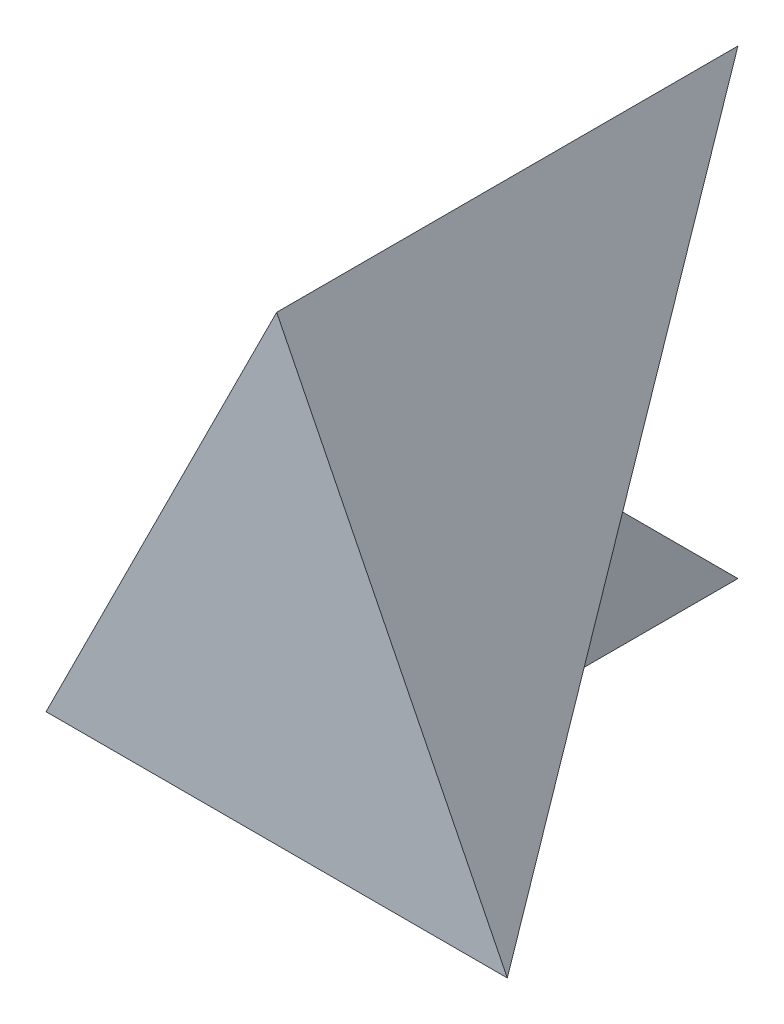
ISO-10303-21;
HEADER;
FILE_DESCRIPTION(('STEP AP214'),'2;1');
FILE_NAME('part.step','',(''),(''),'','','');
FILE_SCHEMA(('AUTOMOTIVE_DESIGN { 1 0 10303 214 1 1 1 1 }'));
ENDSEC;
DATA;
#1=APPLICATION_CONTEXT('core data for automotive mechanical design processes');
#2=APPLICATION_PROTOCOL_DEFINITION('international standard','automotive_design',2000,#1);
#3=PRODUCT_CONTEXT('',#1,'mechanical');
#4=PRODUCT('Part','Part','',(#3));
#5=PRODUCT_RELATED_PRODUCT_CATEGORY('part','',(#4));
#6=PRODUCT_DEFINITION_FORMATION('','',#4);
#7=PRODUCT_DEFINITION_CONTEXT('part definition',#1,'design');
#8=PRODUCT_DEFINITION('design','',#6,#7);
#9=PRODUCT_DEFINITION_SHAPE('','',#8);
#10=(LENGTH_UNIT() NAMED_UNIT(*) SI_UNIT(.MILLI.,.METRE.));
#11=(NAMED_UNIT(*) PLANE_ANGLE_UNIT() SI_UNIT($,.RADIAN.));
#12=(NAMED_UNIT(*) SI_UNIT($,.STERADIAN.) SOLID_ANGLE_UNIT());
#13=UNCERTAINTY_MEASURE_WITH_UNIT(LENGTH_MEASURE(1.E-05),#10,'distance_accuracy_value','');
#14=(GEOMETRIC_REPRESENTATION_CONTEXT(3) GLOBAL_UNCERTAINTY_ASSIGNED_CONTEXT((#13)) GLOBAL_UNIT_ASSIGNED_CONTEXT((#10,
#11,#12)) REPRESENTATION_CONTEXT('',''));
#15=CARTESIAN_POINT('',(0.,0.,0.));
#16=DIRECTION('',(0.,0.,1.));
#17=DIRECTION('',(1.,0.,0.));
#18=AXIS2_PLACEMENT_3D('',#15,#16,#17);
#19=CARTESIAN_POINT('',(-2.,4.,2.));
#20=DIRECTION('',(0.,0.,-1.));
#21=DIRECTION('',(-1.,0.,0.));
#22=AXIS2_PLACEMENT_3D('',#19,#20,#21);
#23=PLANE('',#22);
#24=DIRECTION('',(0.447213595499958,0.894427190999916,0.));
#25=VECTOR('',#24,1.);
#26=CARTESIAN_POINT('',(-0.400000000000001,3.2,2.));
#27=LINE('',#26,#25);
#28=CARTESIAN_POINT('',(-2.,0.,2.));
#29=VERTEX_POINT('',#28);
#30=CARTESIAN_POINT('',(0.,4.,2.));
#31=VERTEX_POINT('',#30);
#32=EDGE_CURVE('E41',#29,#31,#27,.T.);
#33=ORIENTED_EDGE('',*,*,#32,.F.);
#34=DIRECTION('',(1.,0.,0.));
#35=VECTOR('',#34,1.);
#36=CARTESIAN_POINT('',(-2.,0.,2.));
#37=LINE('',#36,#35);
#38=CARTESIAN_POINT('',(0.,0.,2.));
#39=VERTEX_POINT('',#38);
#40=EDGE_CURVE('E107',#29,#39,#37,.T.);
#41=ORIENTED_EDGE('',*,*,#40,.T.);
#42=DIRECTION('',(1.,0.,0.));
#43=VECTOR('',#42,1.);
#44=CARTESIAN_POINT('',(0.,0.,2.));
#45=LINE('',#44,#43);
#46=CARTESIAN_POINT('',(2.,0.,2.));
#47=VERTEX_POINT('',#46);
#48=EDGE_CURVE('E74',#39,#47,#45,.T.);
#49=ORIENTED_EDGE('',*,*,#48,.T.);
#50=DIRECTION('',(-0.447213595499958,0.894427190999916,0.));
#51=VECTOR('',#50,1.);
#52=CARTESIAN_POINT('',(1.6,0.8,2.));
#53=LINE('',#52,#51);
#54=EDGE_CURVE('E72',#47,#31,#53,.T.);
#55=ORIENTED_EDGE('',*,*,#54,.T.);
#56=EDGE_LOOP('',(#33,#41,#49,#55));
#57=FACE_BOUND('',#56,.T.);
#58=ADVANCED_FACE('F33',(#57),#23,.F.);
#59=CARTESIAN_POINT('',(0.,0.,0.));
#60=DIRECTION('',(0.,-1.,0.));
#61=DIRECTION('',(0.,0.,-1.));
#62=AXIS2_PLACEMENT_3D('',#59,#60,#61);
#63=PLANE('',#62);
#64=ORIENTED_EDGE('',*,*,#40,.F.);
#65=DIRECTION('',(-0.447213595499958,0.,0.894427190999916));
#66=VECTOR('',#65,1.);
#67=CARTESIAN_POINT('',(0.,0.,-2.));
#68=LINE('',#67,#66);
#69=CARTESIAN_POINT('',(0.,0.,-2.));
#70=VERTEX_POINT('',#69);
#71=EDGE_CURVE('E12',#70,#29,#68,.T.);
#72=ORIENTED_EDGE('',*,*,#71,.F.);
#73=DIRECTION('',(0.,0.,-1.));
#74=VECTOR('',#73,1.);
#75=CARTESIAN_POINT('',(0.,0.,0.));
#76=LINE('',#75,#74);
#77=EDGE_CURVE('E69',#39,#70,#76,.T.);
#78=ORIENTED_EDGE('',*,*,#77,.F.);
#79=EDGE_LOOP('',(#64,#72,#78));
#80=FACE_BOUND('',#79,.T.);
#81=ADVANCED_FACE('F115',(#80),#63,.T.);
#82=CARTESIAN_POINT('',(0.,1.,1.));
#83=DIRECTION('',(0.,-0.707106781186547,-0.707106781186547));
#84=DIRECTION('',(0.,0.707106781186548,-0.707106781186548));
#85=AXIS2_PLACEMENT_3D('',#82,#83,#84);
#86=PLANE('',#85);
#87=DIRECTION('',(0.,-0.707106781186548,0.707106781186548));
#88=VECTOR('',#87,1.);
#89=CARTESIAN_POINT('',(0.,1.,1.));
#90=LINE('',#89,#88);
#91=CARTESIAN_POINT('',(0.,4.,-2.));
#92=VERTEX_POINT('',#91);
#93=CARTESIAN_POINT('',(0.,2.,0.));
#94=VERTEX_POINT('',#93);
#95=EDGE_CURVE('E85',#92,#94,#90,.T.);
#96=ORIENTED_EDGE('',*,*,#95,.F.);
#97=DIRECTION('',(0.333333333333333,-0.666666666666667,0.666666666666667));
#98=VECTOR('',#97,1.);
#99=CARTESIAN_POINT('',(1.33333333333333,1.33333333333333,0.666666666666667));
#100=LINE('',#99,#98);
#101=EDGE_CURVE('E77',#92,#47,#100,.T.);
#102=ORIENTED_EDGE('',*,*,#101,.T.);
#103=ORIENTED_EDGE('',*,*,#48,.F.);
#104=DIRECTION('',(0.,0.707106781186548,-0.707106781186548));
#105=VECTOR('',#104,1.);
#106=CARTESIAN_POINT('',(0.,1.,1.));
#107=LINE('',#106,#105);
#108=EDGE_CURVE('E86',#39,#94,#107,.T.);
#109=ORIENTED_EDGE('',*,*,#108,.T.);
#110=EDGE_LOOP('',(#96,#102,#103,#109));
#111=FACE_BOUND('',#110,.T.);
#112=ADVANCED_FACE('F122',(#111),#86,.T.);
#113=CARTESIAN_POINT('',(0.,0.,0.));
#114=DIRECTION('',(-1.,0.,0.));
#115=DIRECTION('',(0.,0.,1.));
#116=AXIS2_PLACEMENT_3D('',#113,#114,#115);
#117=PLANE('',#116);
#118=DIRECTION('',(0.,0.,-1.));
#119=VECTOR('',#118,1.);
#120=CARTESIAN_POINT('',(0.,4.,-2.));
#121=LINE('',#120,#119);
#122=EDGE_CURVE('E80',#31,#92,#121,.T.);
#123=ORIENTED_EDGE('',*,*,#122,.T.);
#124=ORIENTED_EDGE('',*,*,#95,.T.);
#125=DIRECTION('',(0.,0.707106781186548,0.707106781186548));
#126=VECTOR('',#125,1.);
#127=CARTESIAN_POINT('',(0.,4.,2.));
#128=LINE('',#127,#126);
#129=EDGE_CURVE('E64',#94,#31,#128,.T.);
#130=ORIENTED_EDGE('',*,*,#129,.T.);
#131=EDGE_LOOP('',(#123,#124,#130));
#132=FACE_BOUND('',#131,.T.);
#133=ADVANCED_FACE('F88',(#132),#117,.T.);
#134=CARTESIAN_POINT('',(0.,0.,0.));
#135=DIRECTION('',(1.,0.,0.));
#136=DIRECTION('',(0.,0.,-1.));
#137=AXIS2_PLACEMENT_3D('',#134,#135,#136);
#138=PLANE('',#137);
#139=EDGE_CURVE('E89',#70,#94,#128,.T.);
#140=ORIENTED_EDGE('',*,*,#139,.T.);
#141=ORIENTED_EDGE('',*,*,#108,.F.);
#142=ORIENTED_EDGE('',*,*,#77,.T.);
#143=EDGE_LOOP('',(#140,#141,#142));
#144=FACE_BOUND('',#143,.T.);
#145=ADVANCED_FACE('F119',(#144),#138,.T.);
#146=CARTESIAN_POINT('',(1.6,0.8,-8.));
#147=DIRECTION('',(0.894427190999916,0.447213595499958,0.));
#148=DIRECTION('',(-0.447213595499958,0.894427190999916,0.));
#149=AXIS2_PLACEMENT_3D('',#146,#147,#148);
#150=PLANE('',#149);
#151=ORIENTED_EDGE('',*,*,#122,.F.);
#152=ORIENTED_EDGE('',*,*,#54,.F.);
#153=ORIENTED_EDGE('',*,*,#101,.F.);
#154=EDGE_LOOP('',(#151,#152,#153));
#155=FACE_BOUND('',#154,.T.);
#156=ADVANCED_FACE('F81',(#155),#150,.T.);
#157=CARTESIAN_POINT('',(-0.666666666666666,0.333333333333333,-0.333333333333334));
#158=DIRECTION('',(-0.816496580927726,0.408248290463863,-0.408248290463863));
#159=DIRECTION('',(-0.447213595499958,0.,0.894427190999916));
#160=AXIS2_PLACEMENT_3D('',#157,#158,#159);
#161=PLANE('',#160);
#162=ORIENTED_EDGE('',*,*,#32,.T.);
#163=ORIENTED_EDGE('',*,*,#129,.F.);
#164=ORIENTED_EDGE('',*,*,#139,.F.);
#165=ORIENTED_EDGE('',*,*,#71,.T.);
#166=EDGE_LOOP('',(#162,#163,#164,#165));
#167=FACE_BOUND('',#166,.T.);
#168=ADVANCED_FACE('F62',(#167),#161,.T.);
#169=CLOSED_SHELL('',(#58,#81,#112,#133,#145,#156,#168));
#170=MANIFOLD_SOLID_BREP('B2',#169);
#171=ADVANCED_BREP_SHAPE_REPRESENTATION('',(#18,#170),#14);
#172=SHAPE_DEFINITION_REPRESENTATION(#9,#171);
ENDSEC;
END-ISO-10303-21;
